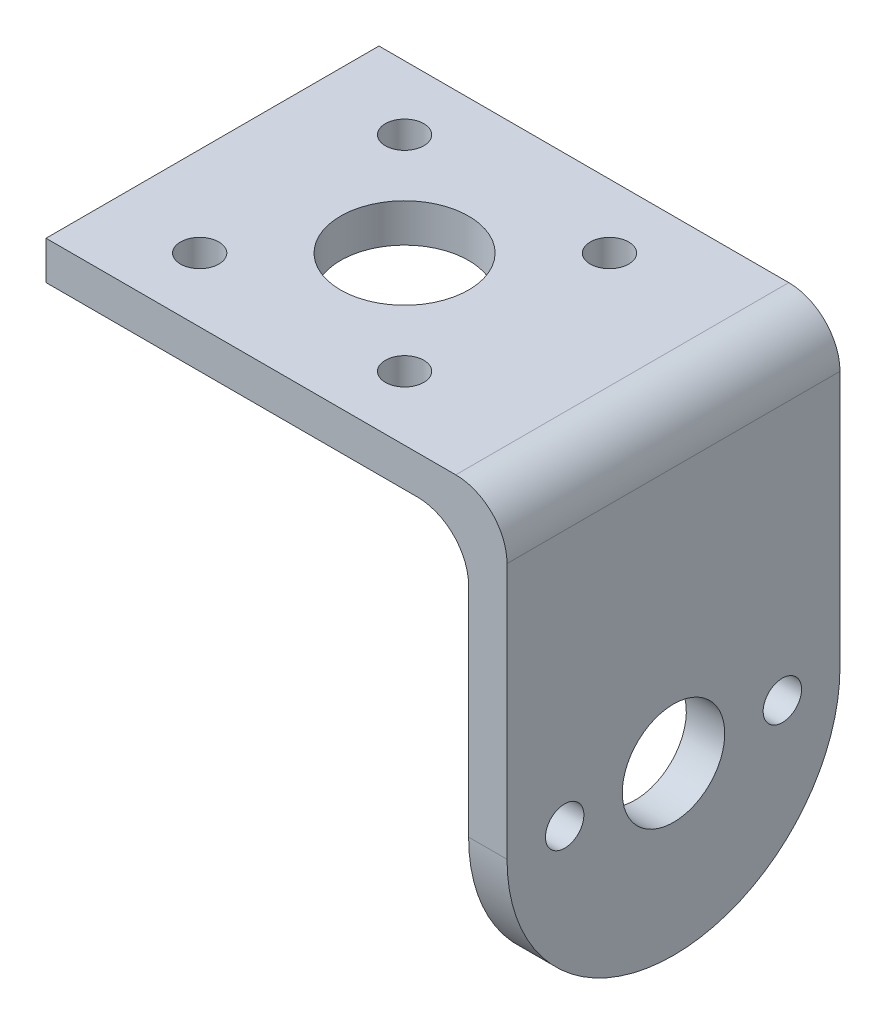
ISO-10303-21;
HEADER;
FILE_DESCRIPTION(('STEP AP214'),'2;1');
FILE_NAME('part.step','',(''),(''),'','','');
FILE_SCHEMA(('AUTOMOTIVE_DESIGN { 1 0 10303 214 1 1 1 1 }'));
ENDSEC;
DATA;
#1=APPLICATION_CONTEXT('core data for automotive mechanical design processes');
#2=APPLICATION_PROTOCOL_DEFINITION('international standard','automotive_design',2000,#1);
#3=PRODUCT_CONTEXT('',#1,'mechanical');
#4=PRODUCT('Part','Part','',(#3));
#5=PRODUCT_RELATED_PRODUCT_CATEGORY('part','',(#4));
#6=PRODUCT_DEFINITION_FORMATION('','',#4);
#7=PRODUCT_DEFINITION_CONTEXT('part definition',#1,'design');
#8=PRODUCT_DEFINITION('design','',#6,#7);
#9=PRODUCT_DEFINITION_SHAPE('','',#8);
#10=(LENGTH_UNIT() NAMED_UNIT(*) SI_UNIT(.MILLI.,.METRE.));
#11=(NAMED_UNIT(*) PLANE_ANGLE_UNIT() SI_UNIT($,.RADIAN.));
#12=(NAMED_UNIT(*) SI_UNIT($,.STERADIAN.) SOLID_ANGLE_UNIT());
#13=UNCERTAINTY_MEASURE_WITH_UNIT(LENGTH_MEASURE(1.E-05),#10,'distance_accuracy_value','');
#14=(GEOMETRIC_REPRESENTATION_CONTEXT(3) GLOBAL_UNCERTAINTY_ASSIGNED_CONTEXT((#13)) GLOBAL_UNIT_ASSIGNED_CONTEXT((#10,
#11,#12)) REPRESENTATION_CONTEXT('',''));
#15=CARTESIAN_POINT('',(0.,0.,0.));
#16=DIRECTION('',(0.,0.,1.));
#17=DIRECTION('',(1.,0.,0.));
#18=AXIS2_PLACEMENT_3D('',#15,#16,#17);
#19=CARTESIAN_POINT('',(33.,0.,26.));
#20=DIRECTION('',(1.,0.,0.));
#21=DIRECTION('',(0.,1.,0.));
#22=AXIS2_PLACEMENT_3D('',#19,#20,#21);
#23=PLANE('',#22);
#24=CARTESIAN_POINT('',(33.,-21.,4.5));
#25=DIRECTION('',(1.,0.,0.));
#26=DIRECTION('',(0.,1.,0.));
#27=AXIS2_PLACEMENT_3D('',#24,#25,#26);
#28=CIRCLE('',#27,1.5);
#29=CARTESIAN_POINT('',(33.,-19.5,4.5));
#30=VERTEX_POINT('',#29);
#31=EDGE_CURVE('E326',#30,#30,#28,.T.);
#32=ORIENTED_EDGE('',*,*,#31,.T.);
#33=EDGE_LOOP('',(#32));
#34=FACE_BOUND('',#33,.T.);
#35=CARTESIAN_POINT('',(33.,-21.,21.5));
#36=DIRECTION('',(1.,0.,0.));
#37=DIRECTION('',(0.,1.,0.));
#38=AXIS2_PLACEMENT_3D('',#35,#36,#37);
#39=CIRCLE('',#38,1.5);
#40=CARTESIAN_POINT('',(33.,-19.5,21.5));
#41=VERTEX_POINT('',#40);
#42=EDGE_CURVE('E174',#41,#41,#39,.T.);
#43=ORIENTED_EDGE('',*,*,#42,.T.);
#44=EDGE_LOOP('',(#43));
#45=FACE_BOUND('',#44,.T.);
#46=CARTESIAN_POINT('',(33.,-21.,13.));
#47=DIRECTION('',(1.,0.,0.));
#48=DIRECTION('',(0.,1.,0.));
#49=AXIS2_PLACEMENT_3D('',#46,#47,#48);
#50=CIRCLE('',#49,4.);
#51=CARTESIAN_POINT('',(33.,-17.,13.));
#52=VERTEX_POINT('',#51);
#53=EDGE_CURVE('E331',#52,#52,#50,.T.);
#54=ORIENTED_EDGE('',*,*,#53,.T.);
#55=EDGE_LOOP('',(#54));
#56=FACE_BOUND('',#55,.T.);
#57=DIRECTION('',(0.,-1.,0.));
#58=VECTOR('',#57,1.);
#59=CARTESIAN_POINT('',(33.,0.,26.));
#60=LINE('',#59,#58);
#61=CARTESIAN_POINT('',(33.,-4.,26.));
#62=VERTEX_POINT('',#61);
#63=CARTESIAN_POINT('',(33.,-21.,26.));
#64=VERTEX_POINT('',#63);
#65=EDGE_CURVE('E224',#62,#64,#60,.T.);
#66=ORIENTED_EDGE('',*,*,#65,.F.);
#67=DIRECTION('',(0.,0.,-1.));
#68=VECTOR('',#67,1.);
#69=CARTESIAN_POINT('',(33.,-4.,0.));
#70=LINE('',#69,#68);
#71=CARTESIAN_POINT('',(33.,-4.,0.));
#72=VERTEX_POINT('',#71);
#73=EDGE_CURVE('E213',#62,#72,#70,.T.);
#74=ORIENTED_EDGE('',*,*,#73,.T.);
#75=DIRECTION('',(0.,-1.,0.));
#76=VECTOR('',#75,1.);
#77=CARTESIAN_POINT('',(33.,0.,0.));
#78=LINE('',#77,#76);
#79=CARTESIAN_POINT('',(33.,-21.,0.));
#80=VERTEX_POINT('',#79);
#81=EDGE_CURVE('E190',#72,#80,#78,.T.);
#82=ORIENTED_EDGE('',*,*,#81,.T.);
#83=CARTESIAN_POINT('',(33.,-21.,13.));
#84=DIRECTION('',(1.,0.,0.));
#85=DIRECTION('',(0.,1.,0.));
#86=AXIS2_PLACEMENT_3D('',#83,#84,#85);
#87=CIRCLE('',#86,13.);
#88=EDGE_CURVE('E173',#64,#80,#87,.T.);
#89=ORIENTED_EDGE('',*,*,#88,.F.);
#90=EDGE_LOOP('',(#66,#74,#82,#89));
#91=FACE_BOUND('',#90,.T.);
#92=ADVANCED_FACE('F98',(#34,#45,#56,#91),#23,.F.);
#93=CARTESIAN_POINT('',(36.,3.,26.));
#94=DIRECTION('',(-1.,0.,0.));
#95=DIRECTION('',(0.,-1.,0.));
#96=AXIS2_PLACEMENT_3D('',#93,#94,#95);
#97=PLANE('',#96);
#98=CARTESIAN_POINT('',(36.,-21.,4.5));
#99=DIRECTION('',(1.,0.,0.));
#100=DIRECTION('',(0.,1.,0.));
#101=AXIS2_PLACEMENT_3D('',#98,#99,#100);
#102=CIRCLE('',#101,1.5);
#103=CARTESIAN_POINT('',(36.,-19.5,4.5));
#104=VERTEX_POINT('',#103);
#105=EDGE_CURVE('E323',#104,#104,#102,.T.);
#106=ORIENTED_EDGE('',*,*,#105,.F.);
#107=EDGE_LOOP('',(#106));
#108=FACE_BOUND('',#107,.T.);
#109=CARTESIAN_POINT('',(36.,-21.,21.5));
#110=DIRECTION('',(1.,0.,0.));
#111=DIRECTION('',(0.,1.,0.));
#112=AXIS2_PLACEMENT_3D('',#109,#110,#111);
#113=CIRCLE('',#112,1.5);
#114=CARTESIAN_POINT('',(36.,-19.5,21.5));
#115=VERTEX_POINT('',#114);
#116=EDGE_CURVE('E334',#115,#115,#113,.T.);
#117=ORIENTED_EDGE('',*,*,#116,.F.);
#118=EDGE_LOOP('',(#117));
#119=FACE_BOUND('',#118,.T.);
#120=CARTESIAN_POINT('',(36.,-21.,13.));
#121=DIRECTION('',(1.,0.,0.));
#122=DIRECTION('',(0.,1.,0.));
#123=AXIS2_PLACEMENT_3D('',#120,#121,#122);
#124=CIRCLE('',#123,4.);
#125=CARTESIAN_POINT('',(36.,-17.,13.));
#126=VERTEX_POINT('',#125);
#127=EDGE_CURVE('E328',#126,#126,#124,.T.);
#128=ORIENTED_EDGE('',*,*,#127,.F.);
#129=EDGE_LOOP('',(#128));
#130=FACE_BOUND('',#129,.T.);
#131=DIRECTION('',(0.,1.,0.));
#132=VECTOR('',#131,1.);
#133=CARTESIAN_POINT('',(36.,3.,0.));
#134=LINE('',#133,#132);
#135=CARTESIAN_POINT('',(36.,-21.,0.));
#136=VERTEX_POINT('',#135);
#137=CARTESIAN_POINT('',(36.,-0.999999999999998,0.));
#138=VERTEX_POINT('',#137);
#139=EDGE_CURVE('E166',#136,#138,#134,.T.);
#140=ORIENTED_EDGE('',*,*,#139,.T.);
#141=DIRECTION('',(0.,0.,-1.));
#142=VECTOR('',#141,1.);
#143=CARTESIAN_POINT('',(36.,-0.999999999999998,26.));
#144=LINE('',#143,#142);
#145=CARTESIAN_POINT('',(36.,-0.999999999999998,26.));
#146=VERTEX_POINT('',#145);
#147=EDGE_CURVE('E209',#138,#146,#144,.F.);
#148=ORIENTED_EDGE('',*,*,#147,.T.);
#149=DIRECTION('',(0.,1.,0.));
#150=VECTOR('',#149,1.);
#151=CARTESIAN_POINT('',(36.,3.,26.));
#152=LINE('',#151,#150);
#153=CARTESIAN_POINT('',(36.,-21.,26.));
#154=VERTEX_POINT('',#153);
#155=EDGE_CURVE('E169',#154,#146,#152,.T.);
#156=ORIENTED_EDGE('',*,*,#155,.F.);
#157=CARTESIAN_POINT('',(36.,-21.,13.));
#158=DIRECTION('',(1.,0.,0.));
#159=DIRECTION('',(0.,1.,0.));
#160=AXIS2_PLACEMENT_3D('',#157,#158,#159);
#161=CIRCLE('',#160,13.);
#162=EDGE_CURVE('E162',#154,#136,#161,.T.);
#163=ORIENTED_EDGE('',*,*,#162,.T.);
#164=EDGE_LOOP('',(#140,#148,#156,#163));
#165=FACE_BOUND('',#164,.T.);
#166=ADVANCED_FACE('F164',(#108,#119,#130,#165),#97,.F.);
#167=CARTESIAN_POINT('',(0.,0.,0.));
#168=DIRECTION('',(0.,0.,1.));
#169=DIRECTION('',(1.,0.,0.));
#170=AXIS2_PLACEMENT_3D('',#167,#168,#169);
#171=PLANE('',#170);
#172=DIRECTION('',(-1.,0.,0.));
#173=VECTOR('',#172,1.);
#174=CARTESIAN_POINT('',(0.,3.,0.));
#175=LINE('',#174,#173);
#176=CARTESIAN_POINT('',(32.,3.,0.));
#177=VERTEX_POINT('',#176);
#178=CARTESIAN_POINT('',(0.,3.,0.));
#179=VERTEX_POINT('',#178);
#180=EDGE_CURVE('E189',#177,#179,#175,.T.);
#181=ORIENTED_EDGE('',*,*,#180,.F.);
#182=CARTESIAN_POINT('',(32.,-0.999999999999999,0.));
#183=DIRECTION('',(0.,0.,1.));
#184=DIRECTION('',(1.,0.,0.));
#185=AXIS2_PLACEMENT_3D('',#182,#183,#184);
#186=CIRCLE('',#185,4.);
#187=EDGE_CURVE('E188',#177,#138,#186,.F.);
#188=ORIENTED_EDGE('',*,*,#187,.T.);
#189=ORIENTED_EDGE('',*,*,#139,.F.);
#190=DIRECTION('',(1.,0.,0.));
#191=VECTOR('',#190,1.);
#192=CARTESIAN_POINT('',(10.,-21.,0.));
#193=LINE('',#192,#191);
#194=EDGE_CURVE('E178',#80,#136,#193,.T.);
#195=ORIENTED_EDGE('',*,*,#194,.F.);
#196=ORIENTED_EDGE('',*,*,#81,.F.);
#197=CARTESIAN_POINT('',(29.,-4.,0.));
#198=DIRECTION('',(0.,0.,1.));
#199=DIRECTION('',(1.,0.,0.));
#200=AXIS2_PLACEMENT_3D('',#197,#198,#199);
#201=CIRCLE('',#200,4.);
#202=CARTESIAN_POINT('',(29.,0.,0.));
#203=VERTEX_POINT('',#202);
#204=EDGE_CURVE('E106',#72,#203,#201,.T.);
#205=ORIENTED_EDGE('',*,*,#204,.T.);
#206=DIRECTION('',(1.,0.,0.));
#207=VECTOR('',#206,1.);
#208=CARTESIAN_POINT('',(0.,0.,0.));
#209=LINE('',#208,#207);
#210=CARTESIAN_POINT('',(0.,0.,0.));
#211=VERTEX_POINT('',#210);
#212=EDGE_CURVE('E194',#211,#203,#209,.T.);
#213=ORIENTED_EDGE('',*,*,#212,.F.);
#214=DIRECTION('',(0.,-1.,0.));
#215=VECTOR('',#214,1.);
#216=CARTESIAN_POINT('',(0.,3.,0.));
#217=LINE('',#216,#215);
#218=EDGE_CURVE('E222',#179,#211,#217,.T.);
#219=ORIENTED_EDGE('',*,*,#218,.F.);
#220=EDGE_LOOP('',(#181,#188,#189,#195,#196,#205,#213,#219));
#221=FACE_BOUND('',#220,.T.);
#222=ADVANCED_FACE('F187',(#221),#171,.F.);
#223=CARTESIAN_POINT('',(0.,0.,26.));
#224=DIRECTION('',(0.,0.,1.));
#225=DIRECTION('',(1.,0.,0.));
#226=AXIS2_PLACEMENT_3D('',#223,#224,#225);
#227=PLANE('',#226);
#228=ORIENTED_EDGE('',*,*,#155,.T.);
#229=CARTESIAN_POINT('',(32.,-0.999999999999999,26.));
#230=DIRECTION('',(0.,0.,1.));
#231=DIRECTION('',(1.,0.,0.));
#232=AXIS2_PLACEMENT_3D('',#229,#230,#231);
#233=CIRCLE('',#232,4.);
#234=CARTESIAN_POINT('',(32.,3.,26.));
#235=VERTEX_POINT('',#234);
#236=EDGE_CURVE('E211',#146,#235,#233,.T.);
#237=ORIENTED_EDGE('',*,*,#236,.T.);
#238=DIRECTION('',(-1.,0.,0.));
#239=VECTOR('',#238,1.);
#240=CARTESIAN_POINT('',(0.,3.,26.));
#241=LINE('',#240,#239);
#242=CARTESIAN_POINT('',(0.,3.,26.));
#243=VERTEX_POINT('',#242);
#244=EDGE_CURVE('E202',#235,#243,#241,.T.);
#245=ORIENTED_EDGE('',*,*,#244,.T.);
#246=DIRECTION('',(0.,-1.,0.));
#247=VECTOR('',#246,1.);
#248=CARTESIAN_POINT('',(0.,3.,26.));
#249=LINE('',#248,#247);
#250=CARTESIAN_POINT('',(0.,0.,26.));
#251=VERTEX_POINT('',#250);
#252=EDGE_CURVE('E192',#243,#251,#249,.T.);
#253=ORIENTED_EDGE('',*,*,#252,.T.);
#254=DIRECTION('',(1.,0.,0.));
#255=VECTOR('',#254,1.);
#256=CARTESIAN_POINT('',(0.,0.,26.));
#257=LINE('',#256,#255);
#258=CARTESIAN_POINT('',(29.,0.,26.));
#259=VERTEX_POINT('',#258);
#260=EDGE_CURVE('E225',#251,#259,#257,.T.);
#261=ORIENTED_EDGE('',*,*,#260,.T.);
#262=CARTESIAN_POINT('',(29.,-4.,26.));
#263=DIRECTION('',(0.,0.,1.));
#264=DIRECTION('',(1.,0.,0.));
#265=AXIS2_PLACEMENT_3D('',#262,#263,#264);
#266=CIRCLE('',#265,4.);
#267=EDGE_CURVE('E12',#259,#62,#266,.F.);
#268=ORIENTED_EDGE('',*,*,#267,.T.);
#269=ORIENTED_EDGE('',*,*,#65,.T.);
#270=DIRECTION('',(1.,0.,0.));
#271=VECTOR('',#270,1.);
#272=CARTESIAN_POINT('',(10.,-21.,26.));
#273=LINE('',#272,#271);
#274=EDGE_CURVE('E184',#64,#154,#273,.T.);
#275=ORIENTED_EDGE('',*,*,#274,.T.);
#276=EDGE_LOOP('',(#228,#237,#245,#253,#261,#268,#269,#275));
#277=FACE_BOUND('',#276,.T.);
#278=ADVANCED_FACE('F237',(#277),#227,.T.);
#279=CARTESIAN_POINT('',(0.,3.,26.));
#280=DIRECTION('',(1.,0.,0.));
#281=DIRECTION('',(0.,0.,-1.));
#282=AXIS2_PLACEMENT_3D('',#279,#280,#281);
#283=PLANE('',#282);
#284=ORIENTED_EDGE('',*,*,#218,.T.);
#285=DIRECTION('',(0.,0.,-1.));
#286=VECTOR('',#285,1.);
#287=CARTESIAN_POINT('',(0.,0.,26.));
#288=LINE('',#287,#286);
#289=EDGE_CURVE('E201',#251,#211,#288,.T.);
#290=ORIENTED_EDGE('',*,*,#289,.F.);
#291=ORIENTED_EDGE('',*,*,#252,.F.);
#292=DIRECTION('',(0.,0.,-1.));
#293=VECTOR('',#292,1.);
#294=CARTESIAN_POINT('',(0.,3.,26.));
#295=LINE('',#294,#293);
#296=EDGE_CURVE('E198',#243,#179,#295,.T.);
#297=ORIENTED_EDGE('',*,*,#296,.T.);
#298=EDGE_LOOP('',(#284,#290,#291,#297));
#299=FACE_BOUND('',#298,.T.);
#300=ADVANCED_FACE('F240',(#299),#283,.F.);
#301=CARTESIAN_POINT('',(0.,0.,26.));
#302=DIRECTION('',(0.,1.,0.));
#303=DIRECTION('',(0.,0.,1.));
#304=AXIS2_PLACEMENT_3D('',#301,#302,#303);
#305=PLANE('',#304);
#306=CARTESIAN_POINT('',(23.,0.,21.));
#307=DIRECTION('',(0.,1.,0.));
#308=DIRECTION('',(0.,0.,1.));
#309=AXIS2_PLACEMENT_3D('',#306,#307,#308);
#310=CIRCLE('',#309,1.5);
#311=CARTESIAN_POINT('',(23.,0.,22.5));
#312=VERTEX_POINT('',#311);
#313=EDGE_CURVE('E309',#312,#312,#310,.T.);
#314=ORIENTED_EDGE('',*,*,#313,.T.);
#315=EDGE_LOOP('',(#314));
#316=FACE_BOUND('',#315,.T.);
#317=CARTESIAN_POINT('',(23.,0.,5.));
#318=DIRECTION('',(0.,1.,0.));
#319=DIRECTION('',(0.,0.,1.));
#320=AXIS2_PLACEMENT_3D('',#317,#318,#319);
#321=CIRCLE('',#320,1.5);
#322=CARTESIAN_POINT('',(23.,0.,6.50000000000001));
#323=VERTEX_POINT('',#322);
#324=EDGE_CURVE('E311',#323,#323,#321,.T.);
#325=ORIENTED_EDGE('',*,*,#324,.T.);
#326=EDGE_LOOP('',(#325));
#327=FACE_BOUND('',#326,.T.);
#328=CARTESIAN_POINT('',(7.,0.,5.));
#329=DIRECTION('',(0.,1.,0.));
#330=DIRECTION('',(0.,0.,1.));
#331=AXIS2_PLACEMENT_3D('',#328,#329,#330);
#332=CIRCLE('',#331,1.5);
#333=CARTESIAN_POINT('',(7.,0.,6.50000000000001));
#334=VERTEX_POINT('',#333);
#335=EDGE_CURVE('E317',#334,#334,#332,.T.);
#336=ORIENTED_EDGE('',*,*,#335,.T.);
#337=EDGE_LOOP('',(#336));
#338=FACE_BOUND('',#337,.T.);
#339=CARTESIAN_POINT('',(7.,0.,21.));
#340=DIRECTION('',(0.,1.,0.));
#341=DIRECTION('',(0.,0.,1.));
#342=AXIS2_PLACEMENT_3D('',#339,#340,#341);
#343=CIRCLE('',#342,1.5);
#344=CARTESIAN_POINT('',(7.,0.,22.5));
#345=VERTEX_POINT('',#344);
#346=EDGE_CURVE('E354',#345,#345,#343,.T.);
#347=ORIENTED_EDGE('',*,*,#346,.T.);
#348=EDGE_LOOP('',(#347));
#349=FACE_BOUND('',#348,.T.);
#350=CARTESIAN_POINT('',(15.,0.,13.));
#351=DIRECTION('',(0.,1.,0.));
#352=DIRECTION('',(0.,0.,1.));
#353=AXIS2_PLACEMENT_3D('',#350,#351,#352);
#354=CIRCLE('',#353,5.);
#355=CARTESIAN_POINT('',(15.,0.,18.));
#356=VERTEX_POINT('',#355);
#357=EDGE_CURVE('E314',#356,#356,#354,.T.);
#358=ORIENTED_EDGE('',*,*,#357,.T.);
#359=EDGE_LOOP('',(#358));
#360=FACE_BOUND('',#359,.T.);
#361=ORIENTED_EDGE('',*,*,#212,.T.);
#362=DIRECTION('',(0.,0.,-1.));
#363=VECTOR('',#362,1.);
#364=CARTESIAN_POINT('',(29.,0.,26.));
#365=LINE('',#364,#363);
#366=EDGE_CURVE('E113',#203,#259,#365,.F.);
#367=ORIENTED_EDGE('',*,*,#366,.T.);
#368=ORIENTED_EDGE('',*,*,#260,.F.);
#369=ORIENTED_EDGE('',*,*,#289,.T.);
#370=EDGE_LOOP('',(#361,#367,#368,#369));
#371=FACE_BOUND('',#370,.T.);
#372=ADVANCED_FACE('F219',(#316,#327,#338,#349,#360,#371),#305,.F.);
#373=CARTESIAN_POINT('',(0.,3.,26.));
#374=DIRECTION('',(0.,-1.,0.));
#375=DIRECTION('',(0.,0.,-1.));
#376=AXIS2_PLACEMENT_3D('',#373,#374,#375);
#377=PLANE('',#376);
#378=CARTESIAN_POINT('',(23.,3.,21.));
#379=DIRECTION('',(0.,1.,0.));
#380=DIRECTION('',(0.,0.,1.));
#381=AXIS2_PLACEMENT_3D('',#378,#379,#380);
#382=CIRCLE('',#381,1.5);
#383=CARTESIAN_POINT('',(23.,3.,22.5));
#384=VERTEX_POINT('',#383);
#385=EDGE_CURVE('E306',#384,#384,#382,.T.);
#386=ORIENTED_EDGE('',*,*,#385,.F.);
#387=EDGE_LOOP('',(#386));
#388=FACE_BOUND('',#387,.T.);
#389=CARTESIAN_POINT('',(23.,3.,5.));
#390=DIRECTION('',(0.,1.,0.));
#391=DIRECTION('',(0.,0.,1.));
#392=AXIS2_PLACEMENT_3D('',#389,#390,#391);
#393=CIRCLE('',#392,1.5);
#394=CARTESIAN_POINT('',(23.,3.,6.50000000000001));
#395=VERTEX_POINT('',#394);
#396=EDGE_CURVE('E363',#395,#395,#393,.T.);
#397=ORIENTED_EDGE('',*,*,#396,.F.);
#398=EDGE_LOOP('',(#397));
#399=FACE_BOUND('',#398,.T.);
#400=CARTESIAN_POINT('',(7.,3.,5.));
#401=DIRECTION('',(0.,1.,0.));
#402=DIRECTION('',(0.,0.,1.));
#403=AXIS2_PLACEMENT_3D('',#400,#401,#402);
#404=CIRCLE('',#403,1.5);
#405=CARTESIAN_POINT('',(7.,3.,6.50000000000001));
#406=VERTEX_POINT('',#405);
#407=EDGE_CURVE('E360',#406,#406,#404,.T.);
#408=ORIENTED_EDGE('',*,*,#407,.F.);
#409=EDGE_LOOP('',(#408));
#410=FACE_BOUND('',#409,.T.);
#411=CARTESIAN_POINT('',(7.,3.,21.));
#412=DIRECTION('',(0.,1.,0.));
#413=DIRECTION('',(0.,0.,1.));
#414=AXIS2_PLACEMENT_3D('',#411,#412,#413);
#415=CIRCLE('',#414,1.5);
#416=CARTESIAN_POINT('',(7.,3.,22.5));
#417=VERTEX_POINT('',#416);
#418=EDGE_CURVE('E357',#417,#417,#415,.T.);
#419=ORIENTED_EDGE('',*,*,#418,.F.);
#420=EDGE_LOOP('',(#419));
#421=FACE_BOUND('',#420,.T.);
#422=CARTESIAN_POINT('',(15.,3.,13.));
#423=DIRECTION('',(0.,1.,0.));
#424=DIRECTION('',(0.,0.,1.));
#425=AXIS2_PLACEMENT_3D('',#422,#423,#424);
#426=CIRCLE('',#425,5.);
#427=CARTESIAN_POINT('',(15.,3.,18.));
#428=VERTEX_POINT('',#427);
#429=EDGE_CURVE('E310',#428,#428,#426,.T.);
#430=ORIENTED_EDGE('',*,*,#429,.F.);
#431=EDGE_LOOP('',(#430));
#432=FACE_BOUND('',#431,.T.);
#433=ORIENTED_EDGE('',*,*,#244,.F.);
#434=DIRECTION('',(0.,0.,-1.));
#435=VECTOR('',#434,1.);
#436=CARTESIAN_POINT('',(32.,3.,26.));
#437=LINE('',#436,#435);
#438=EDGE_CURVE('E183',#235,#177,#437,.T.);
#439=ORIENTED_EDGE('',*,*,#438,.T.);
#440=ORIENTED_EDGE('',*,*,#180,.T.);
#441=ORIENTED_EDGE('',*,*,#296,.F.);
#442=EDGE_LOOP('',(#433,#439,#440,#441));
#443=FACE_BOUND('',#442,.T.);
#444=ADVANCED_FACE('F247',(#388,#399,#410,#421,#432,#443),#377,.F.);
#445=CARTESIAN_POINT('',(10.,-21.,13.));
#446=DIRECTION('',(1.,0.,0.));
#447=DIRECTION('',(0.,1.,0.));
#448=AXIS2_PLACEMENT_3D('',#445,#446,#447);
#449=CYLINDRICAL_SURFACE('',#448,13.);
#450=ORIENTED_EDGE('',*,*,#88,.T.);
#451=ORIENTED_EDGE('',*,*,#194,.T.);
#452=ORIENTED_EDGE('',*,*,#162,.F.);
#453=ORIENTED_EDGE('',*,*,#274,.F.);
#454=EDGE_LOOP('',(#450,#451,#452,#453));
#455=FACE_BOUND('',#454,.T.);
#456=ADVANCED_FACE('F179',(#455),#449,.T.);
#457=CARTESIAN_POINT('',(10.,-21.,21.5));
#458=DIRECTION('',(1.,0.,0.));
#459=DIRECTION('',(0.,1.,0.));
#460=AXIS2_PLACEMENT_3D('',#457,#458,#459);
#461=CYLINDRICAL_SURFACE('',#460,1.5);
#462=ORIENTED_EDGE('',*,*,#116,.T.);
#463=EDGE_LOOP('',(#462));
#464=FACE_BOUND('',#463,.T.);
#465=ORIENTED_EDGE('',*,*,#42,.F.);
#466=EDGE_LOOP('',(#465));
#467=FACE_BOUND('',#466,.T.);
#468=ADVANCED_FACE('F269',(#464,#467),#461,.F.);
#469=CARTESIAN_POINT('',(10.,-21.,13.));
#470=DIRECTION('',(1.,0.,0.));
#471=DIRECTION('',(0.,1.,0.));
#472=AXIS2_PLACEMENT_3D('',#469,#470,#471);
#473=CYLINDRICAL_SURFACE('',#472,4.);
#474=ORIENTED_EDGE('',*,*,#127,.T.);
#475=EDGE_LOOP('',(#474));
#476=FACE_BOUND('',#475,.T.);
#477=ORIENTED_EDGE('',*,*,#53,.F.);
#478=EDGE_LOOP('',(#477));
#479=FACE_BOUND('',#478,.T.);
#480=ADVANCED_FACE('F272',(#476,#479),#473,.F.);
#481=CARTESIAN_POINT('',(10.,-21.,4.5));
#482=DIRECTION('',(1.,0.,0.));
#483=DIRECTION('',(0.,1.,0.));
#484=AXIS2_PLACEMENT_3D('',#481,#482,#483);
#485=CYLINDRICAL_SURFACE('',#484,1.5);
#486=ORIENTED_EDGE('',*,*,#105,.T.);
#487=EDGE_LOOP('',(#486));
#488=FACE_BOUND('',#487,.T.);
#489=ORIENTED_EDGE('',*,*,#31,.F.);
#490=EDGE_LOOP('',(#489));
#491=FACE_BOUND('',#490,.T.);
#492=ADVANCED_FACE('F276',(#488,#491),#485,.F.);
#493=CARTESIAN_POINT('',(32.,-0.999999999999999,26.));
#494=DIRECTION('',(0.,0.,-1.));
#495=DIRECTION('',(-1.,0.,0.));
#496=AXIS2_PLACEMENT_3D('',#493,#494,#495);
#497=CYLINDRICAL_SURFACE('',#496,4.);
#498=ORIENTED_EDGE('',*,*,#236,.F.);
#499=ORIENTED_EDGE('',*,*,#147,.F.);
#500=ORIENTED_EDGE('',*,*,#187,.F.);
#501=ORIENTED_EDGE('',*,*,#438,.F.);
#502=EDGE_LOOP('',(#498,#499,#500,#501));
#503=FACE_BOUND('',#502,.T.);
#504=ADVANCED_FACE('F280',(#503),#497,.T.);
#505=CARTESIAN_POINT('',(29.,-4.,26.));
#506=DIRECTION('',(0.,0.,1.));
#507=DIRECTION('',(1.,0.,0.));
#508=AXIS2_PLACEMENT_3D('',#505,#506,#507);
#509=CYLINDRICAL_SURFACE('',#508,4.);
#510=ORIENTED_EDGE('',*,*,#267,.F.);
#511=ORIENTED_EDGE('',*,*,#366,.F.);
#512=ORIENTED_EDGE('',*,*,#204,.F.);
#513=ORIENTED_EDGE('',*,*,#73,.F.);
#514=EDGE_LOOP('',(#510,#511,#512,#513));
#515=FACE_BOUND('',#514,.T.);
#516=ADVANCED_FACE('F100',(#515),#509,.F.);
#517=CARTESIAN_POINT('',(15.,-23.,13.));
#518=DIRECTION('',(0.,1.,0.));
#519=DIRECTION('',(0.,0.,1.));
#520=AXIS2_PLACEMENT_3D('',#517,#518,#519);
#521=CYLINDRICAL_SURFACE('',#520,5.);
#522=ORIENTED_EDGE('',*,*,#429,.T.);
#523=EDGE_LOOP('',(#522));
#524=FACE_BOUND('',#523,.T.);
#525=ORIENTED_EDGE('',*,*,#357,.F.);
#526=EDGE_LOOP('',(#525));
#527=FACE_BOUND('',#526,.T.);
#528=ADVANCED_FACE('F282',(#524,#527),#521,.F.);
#529=CARTESIAN_POINT('',(7.,-23.,21.));
#530=DIRECTION('',(0.,1.,0.));
#531=DIRECTION('',(0.,0.,1.));
#532=AXIS2_PLACEMENT_3D('',#529,#530,#531);
#533=CYLINDRICAL_SURFACE('',#532,1.5);
#534=ORIENTED_EDGE('',*,*,#418,.T.);
#535=EDGE_LOOP('',(#534));
#536=FACE_BOUND('',#535,.T.);
#537=ORIENTED_EDGE('',*,*,#346,.F.);
#538=EDGE_LOOP('',(#537));
#539=FACE_BOUND('',#538,.T.);
#540=ADVANCED_FACE('F285',(#536,#539),#533,.F.);
#541=CARTESIAN_POINT('',(7.,-23.,5.));
#542=DIRECTION('',(0.,1.,0.));
#543=DIRECTION('',(0.,0.,1.));
#544=AXIS2_PLACEMENT_3D('',#541,#542,#543);
#545=CYLINDRICAL_SURFACE('',#544,1.5);
#546=ORIENTED_EDGE('',*,*,#407,.T.);
#547=EDGE_LOOP('',(#546));
#548=FACE_BOUND('',#547,.T.);
#549=ORIENTED_EDGE('',*,*,#335,.F.);
#550=EDGE_LOOP('',(#549));
#551=FACE_BOUND('',#550,.T.);
#552=ADVANCED_FACE('F289',(#548,#551),#545,.F.);
#553=CARTESIAN_POINT('',(23.,-23.,5.));
#554=DIRECTION('',(0.,1.,0.));
#555=DIRECTION('',(0.,0.,1.));
#556=AXIS2_PLACEMENT_3D('',#553,#554,#555);
#557=CYLINDRICAL_SURFACE('',#556,1.5);
#558=ORIENTED_EDGE('',*,*,#396,.T.);
#559=EDGE_LOOP('',(#558));
#560=FACE_BOUND('',#559,.T.);
#561=ORIENTED_EDGE('',*,*,#324,.F.);
#562=EDGE_LOOP('',(#561));
#563=FACE_BOUND('',#562,.T.);
#564=ADVANCED_FACE('F293',(#560,#563),#557,.F.);
#565=CARTESIAN_POINT('',(23.,-23.,21.));
#566=DIRECTION('',(0.,1.,0.));
#567=DIRECTION('',(0.,0.,1.));
#568=AXIS2_PLACEMENT_3D('',#565,#566,#567);
#569=CYLINDRICAL_SURFACE('',#568,1.5);
#570=ORIENTED_EDGE('',*,*,#385,.T.);
#571=EDGE_LOOP('',(#570));
#572=FACE_BOUND('',#571,.T.);
#573=ORIENTED_EDGE('',*,*,#313,.F.);
#574=EDGE_LOOP('',(#573));
#575=FACE_BOUND('',#574,.T.);
#576=ADVANCED_FACE('F297',(#572,#575),#569,.F.);
#577=CLOSED_SHELL('',(#92,#166,#222,#278,#300,#372,#444,#456,#468,#480,#492,#504,#516,#528,#540,
#552,#564,#576));
#578=MANIFOLD_SOLID_BREP('B2',#577);
#579=ADVANCED_BREP_SHAPE_REPRESENTATION('',(#18,#578),#14);
#580=SHAPE_DEFINITION_REPRESENTATION(#9,#579);
ENDSEC;
END-ISO-10303-21;
